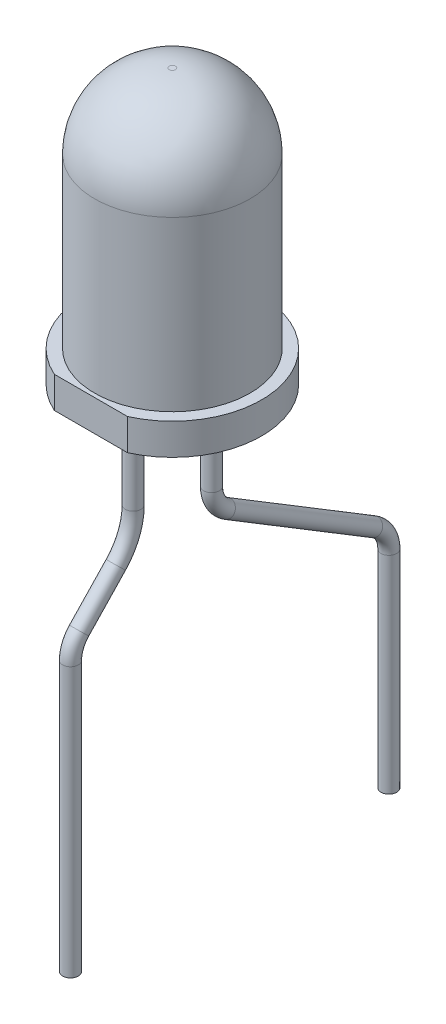
ISO-10303-21;
HEADER;
FILE_DESCRIPTION(('STEP AP214'),'2;1');
FILE_NAME('part.step','',(''),(''),'','','');
FILE_SCHEMA(('AUTOMOTIVE_DESIGN { 1 0 10303 214 1 1 1 1 }'));
ENDSEC;
DATA;
#1=APPLICATION_CONTEXT('core data for automotive mechanical design processes');
#2=APPLICATION_PROTOCOL_DEFINITION('international standard','automotive_design',2000,#1);
#3=PRODUCT_CONTEXT('',#1,'mechanical');
#4=PRODUCT('Part','Part','',(#3));
#5=PRODUCT_RELATED_PRODUCT_CATEGORY('part','',(#4));
#6=PRODUCT_DEFINITION_FORMATION('','',#4);
#7=PRODUCT_DEFINITION_CONTEXT('part definition',#1,'design');
#8=PRODUCT_DEFINITION('design','',#6,#7);
#9=PRODUCT_DEFINITION_SHAPE('','',#8);
#10=(LENGTH_UNIT() NAMED_UNIT(*) SI_UNIT(.MILLI.,.METRE.));
#11=(NAMED_UNIT(*) PLANE_ANGLE_UNIT() SI_UNIT($,.RADIAN.));
#12=(NAMED_UNIT(*) SI_UNIT($,.STERADIAN.) SOLID_ANGLE_UNIT());
#13=UNCERTAINTY_MEASURE_WITH_UNIT(LENGTH_MEASURE(1.E-05),#10,'distance_accuracy_value','');
#14=(GEOMETRIC_REPRESENTATION_CONTEXT(3) GLOBAL_UNCERTAINTY_ASSIGNED_CONTEXT((#13)) GLOBAL_UNIT_ASSIGNED_CONTEXT((#10,
#11,#12)) REPRESENTATION_CONTEXT('',''));
#15=CARTESIAN_POINT('',(0.,0.,0.));
#16=DIRECTION('',(0.,0.,1.));
#17=DIRECTION('',(1.,0.,0.));
#18=AXIS2_PLACEMENT_3D('',#15,#16,#17);
#19=CARTESIAN_POINT('',(0.,0.,0.));
#20=DIRECTION('',(0.,-1.,0.));
#21=DIRECTION('',(0.,0.,-1.));
#22=AXIS2_PLACEMENT_3D('',#19,#20,#21);
#23=PLANE('',#22);
#24=CARTESIAN_POINT('',(0.,0.,1.25));
#25=DIRECTION('',(0.,-1.,0.));
#26=DIRECTION('',(0.,0.,-1.));
#27=AXIS2_PLACEMENT_3D('',#24,#25,#26);
#28=CIRCLE('',#27,0.25);
#29=CARTESIAN_POINT('',(0.,0.,1.));
#30=VERTEX_POINT('',#29);
#31=EDGE_CURVE('E88',#30,#30,#28,.T.);
#32=ORIENTED_EDGE('',*,*,#31,.F.);
#33=EDGE_LOOP('',(#32));
#34=FACE_BOUND('',#33,.T.);
#35=CARTESIAN_POINT('',(0.,0.,-1.25));
#36=DIRECTION('',(0.,-1.,0.));
#37=DIRECTION('',(0.,0.,-1.));
#38=AXIS2_PLACEMENT_3D('',#35,#36,#37);
#39=CIRCLE('',#38,0.25);
#40=CARTESIAN_POINT('',(0.,0.,-1.5));
#41=VERTEX_POINT('',#40);
#42=EDGE_CURVE('E85',#41,#41,#39,.T.);
#43=ORIENTED_EDGE('',*,*,#42,.F.);
#44=EDGE_LOOP('',(#43));
#45=FACE_BOUND('',#44,.T.);
#46=DIRECTION('',(1.,0.,0.));
#47=VECTOR('',#46,1.);
#48=CARTESIAN_POINT('',(-1.16726175299288,0.,2.6));
#49=LINE('',#48,#47);
#50=CARTESIAN_POINT('',(-1.16726175299288,0.,2.6));
#51=VERTEX_POINT('',#50);
#52=CARTESIAN_POINT('',(1.16726175299288,0.,2.6));
#53=VERTEX_POINT('',#52);
#54=EDGE_CURVE('E65',#51,#53,#49,.T.);
#55=ORIENTED_EDGE('',*,*,#54,.F.);
#56=CARTESIAN_POINT('',(0.,0.,0.));
#57=DIRECTION('',(0.,-1.,0.));
#58=DIRECTION('',(0.,0.,-1.));
#59=AXIS2_PLACEMENT_3D('',#56,#57,#58);
#60=CIRCLE('',#59,2.85);
#61=EDGE_CURVE('E11',#51,#53,#60,.T.);
#62=ORIENTED_EDGE('',*,*,#61,.T.);
#63=EDGE_LOOP('',(#55,#62));
#64=FACE_BOUND('',#63,.T.);
#65=ADVANCED_FACE('F36',(#34,#45,#64),#23,.T.);
#66=CARTESIAN_POINT('',(0.,0.,0.));
#67=DIRECTION('',(0.,-1.,0.));
#68=DIRECTION('',(0.,0.,-1.));
#69=AXIS2_PLACEMENT_3D('',#66,#67,#68);
#70=CYLINDRICAL_SURFACE('',#69,2.85);
#71=DIRECTION('',(0.,-1.,0.));
#72=VECTOR('',#71,1.);
#73=CARTESIAN_POINT('',(1.16726175299288,3.34787137637478,2.6));
#74=LINE('',#73,#72);
#75=CARTESIAN_POINT('',(1.16726175299288,1.,2.6));
#76=VERTEX_POINT('',#75);
#77=EDGE_CURVE('E50',#76,#53,#74,.T.);
#78=ORIENTED_EDGE('',*,*,#77,.T.);
#79=ORIENTED_EDGE('',*,*,#61,.F.);
#80=DIRECTION('',(0.,-1.,0.));
#81=VECTOR('',#80,1.);
#82=CARTESIAN_POINT('',(-1.16726175299288,3.34787137637478,2.6));
#83=LINE('',#82,#81);
#84=CARTESIAN_POINT('',(-1.16726175299288,1.,2.6));
#85=VERTEX_POINT('',#84);
#86=EDGE_CURVE('E56',#85,#51,#83,.T.);
#87=ORIENTED_EDGE('',*,*,#86,.F.);
#88=CARTESIAN_POINT('',(0.,1.,0.));
#89=DIRECTION('',(0.,-1.,0.));
#90=DIRECTION('',(0.,0.,-1.));
#91=AXIS2_PLACEMENT_3D('',#88,#89,#90);
#92=CIRCLE('',#91,2.85);
#93=EDGE_CURVE('E43',#85,#76,#92,.T.);
#94=ORIENTED_EDGE('',*,*,#93,.T.);
#95=EDGE_LOOP('',(#78,#79,#87,#94));
#96=FACE_BOUND('',#95,.T.);
#97=ADVANCED_FACE('F69',(#96),#70,.T.);
#98=CARTESIAN_POINT('',(2.85,1.,0.));
#99=DIRECTION('',(0.,1.,0.));
#100=DIRECTION('',(0.,0.,1.));
#101=AXIS2_PLACEMENT_3D('',#98,#99,#100);
#102=PLANE('',#101);
#103=DIRECTION('',(1.,0.,0.));
#104=VECTOR('',#103,1.);
#105=CARTESIAN_POINT('',(-1.16726175299288,1.,2.6));
#106=LINE('',#105,#104);
#107=EDGE_CURVE('E60',#85,#76,#106,.T.);
#108=ORIENTED_EDGE('',*,*,#107,.T.);
#109=ORIENTED_EDGE('',*,*,#93,.F.);
#110=EDGE_LOOP('',(#108,#109));
#111=FACE_BOUND('',#110,.T.);
#112=CARTESIAN_POINT('',(0.,1.,0.));
#113=DIRECTION('',(0.,-1.,0.));
#114=DIRECTION('',(0.,0.,-1.));
#115=AXIS2_PLACEMENT_3D('',#112,#113,#114);
#116=CIRCLE('',#115,2.48);
#117=CARTESIAN_POINT('',(0.,1.,-2.48));
#118=VERTEX_POINT('',#117);
#119=EDGE_CURVE('E74',#118,#118,#116,.T.);
#120=ORIENTED_EDGE('',*,*,#119,.T.);
#121=EDGE_LOOP('',(#120));
#122=FACE_BOUND('',#121,.T.);
#123=ADVANCED_FACE('F72',(#111,#122),#102,.T.);
#124=CARTESIAN_POINT('',(0.,0.,0.));
#125=DIRECTION('',(0.,-1.,0.));
#126=DIRECTION('',(0.,0.,-1.));
#127=AXIS2_PLACEMENT_3D('',#124,#125,#126);
#128=CYLINDRICAL_SURFACE('',#127,2.48);
#129=CARTESIAN_POINT('',(0.,6.37,0.));
#130=DIRECTION('',(0.,-1.,0.));
#131=DIRECTION('',(0.,0.,-1.));
#132=AXIS2_PLACEMENT_3D('',#129,#130,#131);
#133=CIRCLE('',#132,2.48);
#134=CARTESIAN_POINT('',(0.,6.37,-2.48));
#135=VERTEX_POINT('',#134);
#136=EDGE_CURVE('E76',#135,#135,#133,.T.);
#137=ORIENTED_EDGE('',*,*,#136,.T.);
#138=EDGE_LOOP('',(#137));
#139=FACE_BOUND('',#138,.T.);
#140=ORIENTED_EDGE('',*,*,#119,.F.);
#141=EDGE_LOOP('',(#140));
#142=FACE_BOUND('',#141,.T.);
#143=ADVANCED_FACE('F293',(#139,#142),#128,.T.);
#144=CARTESIAN_POINT('',(0.,6.37,0.));
#145=DIRECTION('',(0.,-1.,0.));
#146=DIRECTION('',(0.,0.,-1.));
#147=AXIS2_PLACEMENT_3D('',#144,#145,#146);
#148=DEGENERATE_TOROIDAL_SURFACE('',#147,0.1,2.38,.T.);
#149=CARTESIAN_POINT('',(0.,8.75,0.));
#150=DIRECTION('',(0.,-1.,0.));
#151=DIRECTION('',(0.,0.,-1.));
#152=AXIS2_PLACEMENT_3D('',#149,#150,#151);
#153=CIRCLE('',#152,0.1);
#154=CARTESIAN_POINT('',(0.,8.75,-0.1));
#155=VERTEX_POINT('',#154);
#156=EDGE_CURVE('E70',#155,#155,#153,.T.);
#157=ORIENTED_EDGE('',*,*,#156,.T.);
#158=EDGE_LOOP('',(#157));
#159=FACE_BOUND('',#158,.T.);
#160=ORIENTED_EDGE('',*,*,#136,.F.);
#161=EDGE_LOOP('',(#160));
#162=FACE_BOUND('',#161,.T.);
#163=ADVANCED_FACE('F307',(#159,#162),#148,.T.);
#164=CARTESIAN_POINT('',(0.,8.75,0.));
#165=DIRECTION('',(0.,1.,0.));
#166=DIRECTION('',(0.,0.,1.));
#167=AXIS2_PLACEMENT_3D('',#164,#165,#166);
#168=PLANE('',#167);
#169=ORIENTED_EDGE('',*,*,#156,.F.);
#170=EDGE_LOOP('',(#169));
#171=FACE_BOUND('',#170,.T.);
#172=ADVANCED_FACE('F137',(#171),#168,.T.);
#173=CARTESIAN_POINT('',(-1.16726175299288,3.34787137637478,2.6));
#174=DIRECTION('',(0.,0.,-1.));
#175=DIRECTION('',(-1.,0.,0.));
#176=AXIS2_PLACEMENT_3D('',#173,#174,#175);
#177=PLANE('',#176);
#178=ORIENTED_EDGE('',*,*,#86,.T.);
#179=ORIENTED_EDGE('',*,*,#54,.T.);
#180=ORIENTED_EDGE('',*,*,#77,.F.);
#181=ORIENTED_EDGE('',*,*,#107,.F.);
#182=EDGE_LOOP('',(#178,#179,#180,#181));
#183=FACE_BOUND('',#182,.T.);
#184=ADVANCED_FACE('F61',(#183),#177,.F.);
#185=CARTESIAN_POINT('',(0.,-2.,-1.25));
#186=DIRECTION('',(0.,1.,0.));
#187=DIRECTION('',(0.,0.,1.));
#188=AXIS2_PLACEMENT_3D('',#185,#186,#187);
#189=CYLINDRICAL_SURFACE('',#188,0.25);
#190=ORIENTED_EDGE('',*,*,#42,.T.);
#191=EDGE_LOOP('',(#190));
#192=FACE_BOUND('',#191,.T.);
#193=CARTESIAN_POINT('',(0.,-3.43733882567167,-1.25));
#194=DIRECTION('',(0.,-1.,0.));
#195=DIRECTION('',(0.,0.,-1.));
#196=AXIS2_PLACEMENT_3D('',#193,#194,#195);
#197=CIRCLE('',#196,0.25);
#198=CARTESIAN_POINT('',(0.,-3.43733882567167,-1.));
#199=VERTEX_POINT('',#198);
#200=EDGE_CURVE('E118',#199,#199,#197,.T.);
#201=ORIENTED_EDGE('',*,*,#200,.F.);
#202=EDGE_LOOP('',(#201));
#203=FACE_BOUND('',#202,.T.);
#204=ADVANCED_FACE('F124',(#192,#203),#189,.T.);
#205=CARTESIAN_POINT('',(0.,-2.,1.25));
#206=DIRECTION('',(0.,1.,0.));
#207=DIRECTION('',(0.,0.,1.));
#208=AXIS2_PLACEMENT_3D('',#205,#206,#207);
#209=CYLINDRICAL_SURFACE('',#208,0.25);
#210=ORIENTED_EDGE('',*,*,#31,.T.);
#211=EDGE_LOOP('',(#210));
#212=FACE_BOUND('',#211,.T.);
#213=CARTESIAN_POINT('',(0.,-2.7,1.25));
#214=DIRECTION('',(0.,-1.,0.));
#215=DIRECTION('',(0.,0.,-1.));
#216=AXIS2_PLACEMENT_3D('',#213,#214,#215);
#217=CIRCLE('',#216,0.25);
#218=CARTESIAN_POINT('',(0.,-2.7,1.));
#219=VERTEX_POINT('',#218);
#220=EDGE_CURVE('E103',#219,#219,#217,.T.);
#221=ORIENTED_EDGE('',*,*,#220,.F.);
#222=EDGE_LOOP('',(#221));
#223=FACE_BOUND('',#222,.T.);
#224=ADVANCED_FACE('F126',(#212,#223),#209,.T.);
#225=CARTESIAN_POINT('',(0.,-14.6,3.25));
#226=DIRECTION('',(0.,-1.,0.));
#227=DIRECTION('',(0.,0.,-1.));
#228=AXIS2_PLACEMENT_3D('',#225,#226,#227);
#229=PLANE('',#228);
#230=CARTESIAN_POINT('',(0.,-14.6,3.25));
#231=DIRECTION('',(0.,-1.,0.));
#232=DIRECTION('',(0.,0.,-1.));
#233=AXIS2_PLACEMENT_3D('',#230,#231,#232);
#234=CIRCLE('',#233,0.25);
#235=CARTESIAN_POINT('',(0.,-14.6,3.));
#236=VERTEX_POINT('',#235);
#237=EDGE_CURVE('E91',#236,#236,#234,.T.);
#238=ORIENTED_EDGE('',*,*,#237,.T.);
#239=EDGE_LOOP('',(#238));
#240=FACE_BOUND('',#239,.T.);
#241=ADVANCED_FACE('F133',(#240),#229,.T.);
#242=CARTESIAN_POINT('',(0.,-2.7,3.25));
#243=DIRECTION('',(-1.,0.,0.));
#244=DIRECTION('',(0.,0.,1.));
#245=AXIS2_PLACEMENT_3D('',#242,#243,#244);
#246=TOROIDAL_SURFACE('',#245,2.,0.25);
#247=CARTESIAN_POINT('',(0.,-4.07931034482759,1.80172413793103));
#248=DIRECTION('',(0.,-0.724137931034485,0.689655172413791));
#249=DIRECTION('',(0.,-0.689655172413791,-0.724137931034485));
#250=AXIS2_PLACEMENT_3D('',#247,#248,#249);
#251=CIRCLE('',#250,0.25);
#252=CARTESIAN_POINT('',(0.,-4.25172413793103,1.62068965517241));
#253=VERTEX_POINT('',#252);
#254=EDGE_CURVE('E100',#253,#253,#251,.T.);
#255=CARTESIAN_POINT('',(0.,-2.7,3.25));
#256=DIRECTION('',(-1.,0.,0.));
#257=DIRECTION('',(0.,0.,1.));
#258=AXIS2_PLACEMENT_3D('',#255,#256,#257);
#259=CIRCLE('',#258,2.25);
#260=EDGE_CURVE('',#219,#253,#259,.T.);
#261=ORIENTED_EDGE('',*,*,#220,.T.);
#262=ORIENTED_EDGE('',*,*,#254,.F.);
#263=ORIENTED_EDGE('',*,*,#260,.T.);
#264=ORIENTED_EDGE('',*,*,#260,.F.);
#265=EDGE_LOOP('',(#261,#263,#262,#264));
#266=FACE_BOUND('',#265,.T.);
#267=ADVANCED_FACE('F151',(#266),#246,.T.);
#268=CARTESIAN_POINT('',(0.,-4.07931034482759,1.80172413793103));
#269=DIRECTION('',(0.,-0.724137931034485,0.689655172413791));
#270=DIRECTION('',(0.,-0.689655172413791,-0.724137931034485));
#271=AXIS2_PLACEMENT_3D('',#268,#269,#270);
#272=CYLINDRICAL_SURFACE('',#271,0.25);
#273=CARTESIAN_POINT('',(0.,-5.31034482758622,2.97413793103448));
#274=DIRECTION('',(0.,-0.724137931034485,0.689655172413791));
#275=DIRECTION('',(0.,-0.689655172413791,-0.724137931034485));
#276=AXIS2_PLACEMENT_3D('',#273,#274,#275);
#277=CIRCLE('',#276,0.25);
#278=CARTESIAN_POINT('',(0.,-5.13793103448277,3.1551724137931));
#279=VERTEX_POINT('',#278);
#280=EDGE_CURVE('E97',#279,#279,#277,.T.);
#281=ORIENTED_EDGE('',*,*,#280,.F.);
#282=EDGE_LOOP('',(#281));
#283=FACE_BOUND('',#282,.T.);
#284=ORIENTED_EDGE('',*,*,#254,.T.);
#285=EDGE_LOOP('',(#284));
#286=FACE_BOUND('',#285,.T.);
#287=ADVANCED_FACE('F153',(#283,#286),#272,.T.);
#288=CARTESIAN_POINT('',(0.,-6.00000000000001,2.25));
#289=DIRECTION('',(1.,0.,0.));
#290=DIRECTION('',(0.,0.,-1.));
#291=AXIS2_PLACEMENT_3D('',#288,#289,#290);
#292=TOROIDAL_SURFACE('',#291,0.999999999999997,0.25);
#293=CARTESIAN_POINT('',(0.,-6.00000000000001,3.25));
#294=DIRECTION('',(0.,-1.,0.));
#295=DIRECTION('',(0.,0.,-1.));
#296=AXIS2_PLACEMENT_3D('',#293,#294,#295);
#297=CIRCLE('',#296,0.25);
#298=CARTESIAN_POINT('',(0.,-6.00000000000001,3.5));
#299=VERTEX_POINT('',#298);
#300=EDGE_CURVE('E94',#299,#299,#297,.T.);
#301=CARTESIAN_POINT('',(0.,-6.00000000000001,2.25));
#302=DIRECTION('',(1.,0.,0.));
#303=DIRECTION('',(0.,0.,-1.));
#304=AXIS2_PLACEMENT_3D('',#301,#302,#303);
#305=CIRCLE('',#304,1.25);
#306=EDGE_CURVE('',#279,#299,#305,.T.);
#307=ORIENTED_EDGE('',*,*,#280,.T.);
#308=ORIENTED_EDGE('',*,*,#300,.F.);
#309=ORIENTED_EDGE('',*,*,#306,.T.);
#310=ORIENTED_EDGE('',*,*,#306,.F.);
#311=EDGE_LOOP('',(#307,#309,#308,#310));
#312=FACE_BOUND('',#311,.T.);
#313=ADVANCED_FACE('F160',(#312),#292,.T.);
#314=CARTESIAN_POINT('',(0.,-6.00000000000001,3.25));
#315=DIRECTION('',(0.,-1.,0.));
#316=DIRECTION('',(0.,0.,-1.));
#317=AXIS2_PLACEMENT_3D('',#314,#315,#316);
#318=CYLINDRICAL_SURFACE('',#317,0.25);
#319=ORIENTED_EDGE('',*,*,#237,.F.);
#320=EDGE_LOOP('',(#319));
#321=FACE_BOUND('',#320,.T.);
#322=ORIENTED_EDGE('',*,*,#300,.T.);
#323=EDGE_LOOP('',(#322));
#324=FACE_BOUND('',#323,.T.);
#325=ADVANCED_FACE('F136',(#321,#324),#318,.T.);
#326=CARTESIAN_POINT('',(0.,-14.6,-6.91));
#327=DIRECTION('',(0.,-1.,0.));
#328=DIRECTION('',(0.,0.,-1.));
#329=AXIS2_PLACEMENT_3D('',#326,#327,#328);
#330=PLANE('',#329);
#331=CARTESIAN_POINT('',(0.,-14.6,-6.91));
#332=DIRECTION('',(0.,-1.,0.));
#333=DIRECTION('',(0.,0.,-1.));
#334=AXIS2_PLACEMENT_3D('',#331,#332,#333);
#335=CIRCLE('',#334,0.25);
#336=CARTESIAN_POINT('',(0.,-14.6,-7.16));
#337=VERTEX_POINT('',#336);
#338=EDGE_CURVE('E106',#337,#337,#335,.T.);
#339=ORIENTED_EDGE('',*,*,#338,.T.);
#340=EDGE_LOOP('',(#339));
#341=FACE_BOUND('',#340,.T.);
#342=ADVANCED_FACE('F168',(#341),#330,.T.);
#343=CARTESIAN_POINT('',(0.,-3.43733882567167,-2.25));
#344=DIRECTION('',(1.,0.,0.));
#345=DIRECTION('',(0.,0.,-1.));
#346=AXIS2_PLACEMENT_3D('',#343,#344,#345);
#347=TOROIDAL_SURFACE('',#346,0.999999999999998,0.25);
#348=CARTESIAN_POINT('',(0.,-4.29206535593698,-1.73092143324866));
#349=DIRECTION('',(0.,-0.519078566751339,-0.85472653026531));
#350=DIRECTION('',(0.,0.85472653026531,-0.519078566751339));
#351=AXIS2_PLACEMENT_3D('',#348,#349,#350);
#352=CIRCLE('',#351,0.25);
#353=CARTESIAN_POINT('',(0.,-4.5057469885033,-1.60115179156083));
#354=VERTEX_POINT('',#353);
#355=EDGE_CURVE('E115',#354,#354,#352,.T.);
#356=CARTESIAN_POINT('',(0.,-3.43733882567167,-2.25));
#357=DIRECTION('',(1.,0.,0.));
#358=DIRECTION('',(0.,0.,-1.));
#359=AXIS2_PLACEMENT_3D('',#356,#357,#358);
#360=CIRCLE('',#359,1.25);
#361=EDGE_CURVE('',#199,#354,#360,.T.);
#362=ORIENTED_EDGE('',*,*,#200,.T.);
#363=ORIENTED_EDGE('',*,*,#355,.F.);
#364=ORIENTED_EDGE('',*,*,#361,.T.);
#365=ORIENTED_EDGE('',*,*,#361,.F.);
#366=EDGE_LOOP('',(#362,#364,#363,#365));
#367=FACE_BOUND('',#366,.T.);
#368=ADVANCED_FACE('F122',(#367),#347,.T.);
#369=CARTESIAN_POINT('',(0.,-4.29206535593698,-1.73092143324866));
#370=DIRECTION('',(0.,-0.519078566751339,-0.85472653026531));
#371=DIRECTION('',(0.,0.85472653026531,-0.519078566751339));
#372=AXIS2_PLACEMENT_3D('',#369,#370,#371);
#373=CYLINDRICAL_SURFACE('',#372,0.25);
#374=CARTESIAN_POINT('',(0.,-7.14527346973469,-6.42907856675134));
#375=DIRECTION('',(0.,-0.519078566751339,-0.85472653026531));
#376=DIRECTION('',(0.,0.85472653026531,-0.519078566751339));
#377=AXIS2_PLACEMENT_3D('',#374,#375,#376);
#378=CIRCLE('',#377,0.25);
#379=CARTESIAN_POINT('',(0.,-6.93159183716836,-6.55884820843917));
#380=VERTEX_POINT('',#379);
#381=EDGE_CURVE('E112',#380,#380,#378,.T.);
#382=ORIENTED_EDGE('',*,*,#381,.F.);
#383=EDGE_LOOP('',(#382));
#384=FACE_BOUND('',#383,.T.);
#385=ORIENTED_EDGE('',*,*,#355,.T.);
#386=EDGE_LOOP('',(#385));
#387=FACE_BOUND('',#386,.T.);
#388=ADVANCED_FACE('F189',(#384,#387),#373,.T.);
#389=CARTESIAN_POINT('',(0.,-8.,-5.91));
#390=DIRECTION('',(-1.,0.,0.));
#391=DIRECTION('',(0.,0.,1.));
#392=AXIS2_PLACEMENT_3D('',#389,#390,#391);
#393=TOROIDAL_SURFACE('',#392,0.999999999999999,0.25);
#394=CARTESIAN_POINT('',(0.,-8.,-6.91));
#395=DIRECTION('',(0.,-1.,0.));
#396=DIRECTION('',(0.,0.,-1.));
#397=AXIS2_PLACEMENT_3D('',#394,#395,#396);
#398=CIRCLE('',#397,0.25);
#399=CARTESIAN_POINT('',(0.,-8.,-7.16));
#400=VERTEX_POINT('',#399);
#401=EDGE_CURVE('E109',#400,#400,#398,.T.);
#402=CARTESIAN_POINT('',(0.,-8.,-5.91));
#403=DIRECTION('',(-1.,0.,0.));
#404=DIRECTION('',(0.,0.,1.));
#405=AXIS2_PLACEMENT_3D('',#402,#403,#404);
#406=CIRCLE('',#405,1.25);
#407=EDGE_CURVE('',#380,#400,#406,.T.);
#408=ORIENTED_EDGE('',*,*,#381,.T.);
#409=ORIENTED_EDGE('',*,*,#401,.F.);
#410=ORIENTED_EDGE('',*,*,#407,.T.);
#411=ORIENTED_EDGE('',*,*,#407,.F.);
#412=EDGE_LOOP('',(#408,#410,#409,#411));
#413=FACE_BOUND('',#412,.T.);
#414=ADVANCED_FACE('F196',(#413),#393,.T.);
#415=CARTESIAN_POINT('',(0.,-8.,-6.91));
#416=DIRECTION('',(0.,-1.,0.));
#417=DIRECTION('',(0.,0.,-1.));
#418=AXIS2_PLACEMENT_3D('',#415,#416,#417);
#419=CYLINDRICAL_SURFACE('',#418,0.25);
#420=ORIENTED_EDGE('',*,*,#338,.F.);
#421=EDGE_LOOP('',(#420));
#422=FACE_BOUND('',#421,.T.);
#423=ORIENTED_EDGE('',*,*,#401,.T.);
#424=EDGE_LOOP('',(#423));
#425=FACE_BOUND('',#424,.T.);
#426=ADVANCED_FACE('F165',(#422,#425),#419,.T.);
#427=CLOSED_SHELL('',(#65,#97,#123,#143,#163,#172,#184,#204,#224,#241,#267,#287,#313,#325,#342,
#368,#388,#414,#426));
#428=MANIFOLD_SOLID_BREP('B2',#427);
#429=ADVANCED_BREP_SHAPE_REPRESENTATION('',(#18,#428),#14);
#430=SHAPE_DEFINITION_REPRESENTATION(#9,#429);
ENDSEC;
END-ISO-10303-21;
